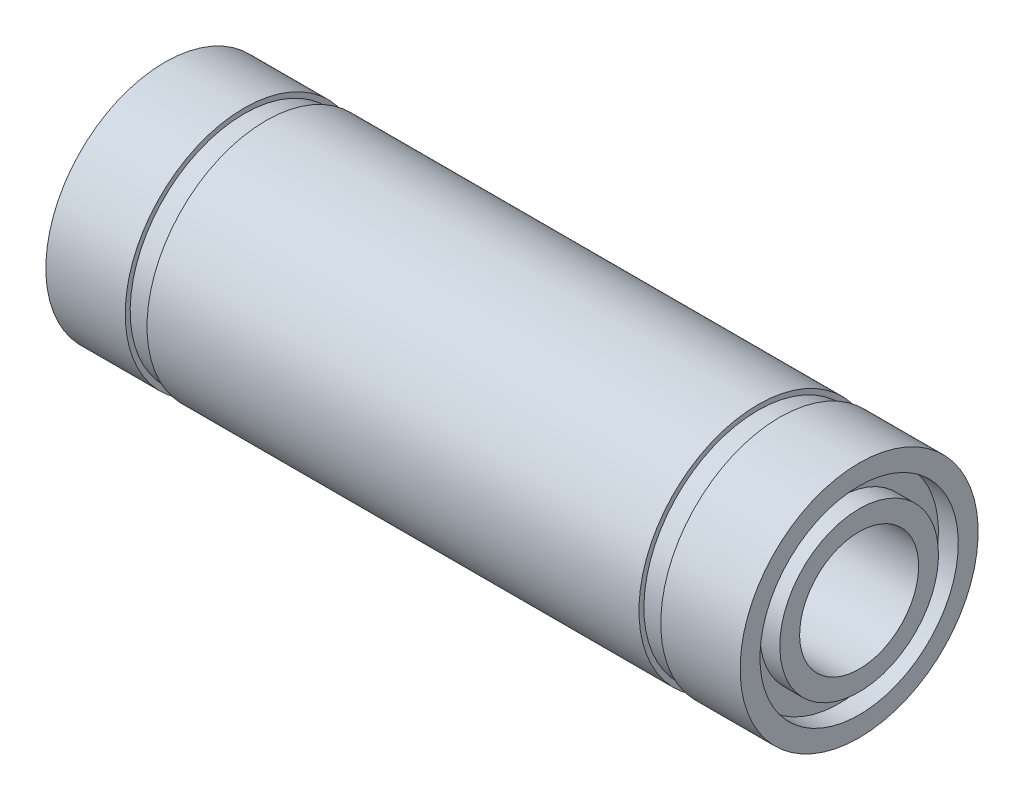
ISO-10303-21;
HEADER;
FILE_DESCRIPTION(('STEP AP214'),'2;1');
FILE_NAME('part.step','',(''),(''),'','','');
FILE_SCHEMA(('AUTOMOTIVE_DESIGN { 1 0 10303 214 1 1 1 1 }'));
ENDSEC;
DATA;
#1=APPLICATION_CONTEXT('core data for automotive mechanical design processes');
#2=APPLICATION_PROTOCOL_DEFINITION('international standard','automotive_design',2000,#1);
#3=PRODUCT_CONTEXT('',#1,'mechanical');
#4=PRODUCT('Part','Part','',(#3));
#5=PRODUCT_RELATED_PRODUCT_CATEGORY('part','',(#4));
#6=PRODUCT_DEFINITION_FORMATION('','',#4);
#7=PRODUCT_DEFINITION_CONTEXT('part definition',#1,'design');
#8=PRODUCT_DEFINITION('design','',#6,#7);
#9=PRODUCT_DEFINITION_SHAPE('','',#8);
#10=(LENGTH_UNIT() NAMED_UNIT(*) SI_UNIT(.MILLI.,.METRE.));
#11=(NAMED_UNIT(*) PLANE_ANGLE_UNIT() SI_UNIT($,.RADIAN.));
#12=(NAMED_UNIT(*) SI_UNIT($,.STERADIAN.) SOLID_ANGLE_UNIT());
#13=UNCERTAINTY_MEASURE_WITH_UNIT(LENGTH_MEASURE(1.E-05),#10,'distance_accuracy_value','');
#14=(GEOMETRIC_REPRESENTATION_CONTEXT(3) GLOBAL_UNCERTAINTY_ASSIGNED_CONTEXT((#13)) GLOBAL_UNIT_ASSIGNED_CONTEXT((#10,
#11,#12)) REPRESENTATION_CONTEXT('',''));
#15=CARTESIAN_POINT('',(0.,0.,0.));
#16=DIRECTION('',(0.,0.,1.));
#17=DIRECTION('',(1.,0.,0.));
#18=AXIS2_PLACEMENT_3D('',#15,#16,#17);
#19=CARTESIAN_POINT('',(-17.5,5.,0.));
#20=DIRECTION('',(-1.,0.,0.));
#21=DIRECTION('',(0.,-1.,0.));
#22=AXIS2_PLACEMENT_3D('',#19,#20,#21);
#23=PLANE('',#22);
#24=CARTESIAN_POINT('',(-17.5,0.,0.));
#25=DIRECTION('',(1.,0.,0.));
#26=DIRECTION('',(0.,1.,0.));
#27=AXIS2_PLACEMENT_3D('',#24,#25,#26);
#28=CIRCLE('',#27,5.);
#29=CARTESIAN_POINT('',(-17.5,5.,0.));
#30=VERTEX_POINT('',#29);
#31=EDGE_CURVE('E124',#30,#30,#28,.T.);
#32=ORIENTED_EDGE('',*,*,#31,.T.);
#33=EDGE_LOOP('',(#32));
#34=FACE_BOUND('',#33,.T.);
#35=CARTESIAN_POINT('',(-17.5,0.,0.));
#36=DIRECTION('',(1.,0.,0.));
#37=DIRECTION('',(0.,1.,0.));
#38=AXIS2_PLACEMENT_3D('',#35,#36,#37);
#39=CIRCLE('',#38,6.);
#40=CARTESIAN_POINT('',(-17.5,6.,0.));
#41=VERTEX_POINT('',#40);
#42=EDGE_CURVE('E10',#41,#41,#39,.T.);
#43=ORIENTED_EDGE('',*,*,#42,.F.);
#44=EDGE_LOOP('',(#43));
#45=FACE_BOUND('',#44,.T.);
#46=ADVANCED_FACE('F40',(#34,#45),#23,.T.);
#47=CARTESIAN_POINT('',(0.,0.,0.));
#48=DIRECTION('',(1.,0.,0.));
#49=DIRECTION('',(0.,1.,0.));
#50=AXIS2_PLACEMENT_3D('',#47,#48,#49);
#51=CYLINDRICAL_SURFACE('',#50,6.);
#52=ORIENTED_EDGE('',*,*,#42,.T.);
#53=EDGE_LOOP('',(#52));
#54=FACE_BOUND('',#53,.T.);
#55=CARTESIAN_POINT('',(-13.5,0.,0.));
#56=DIRECTION('',(1.,0.,0.));
#57=DIRECTION('',(0.,1.,0.));
#58=AXIS2_PLACEMENT_3D('',#55,#56,#57);
#59=CIRCLE('',#58,6.);
#60=CARTESIAN_POINT('',(-13.5,6.,0.));
#61=VERTEX_POINT('',#60);
#62=EDGE_CURVE('E47',#61,#61,#59,.T.);
#63=ORIENTED_EDGE('',*,*,#62,.F.);
#64=EDGE_LOOP('',(#63));
#65=FACE_BOUND('',#64,.T.);
#66=ADVANCED_FACE('F142',(#54,#65),#51,.T.);
#67=CARTESIAN_POINT('',(-13.5,6.,0.));
#68=DIRECTION('',(1.,0.,0.));
#69=DIRECTION('',(0.,1.,0.));
#70=AXIS2_PLACEMENT_3D('',#67,#68,#69);
#71=PLANE('',#70);
#72=ORIENTED_EDGE('',*,*,#62,.T.);
#73=EDGE_LOOP('',(#72));
#74=FACE_BOUND('',#73,.T.);
#75=CARTESIAN_POINT('',(-13.5,0.,0.));
#76=DIRECTION('',(1.,0.,0.));
#77=DIRECTION('',(0.,1.,0.));
#78=AXIS2_PLACEMENT_3D('',#75,#76,#77);
#79=CIRCLE('',#78,5.75);
#80=CARTESIAN_POINT('',(-13.5,5.75,0.));
#81=VERTEX_POINT('',#80);
#82=EDGE_CURVE('E54',#81,#81,#79,.T.);
#83=ORIENTED_EDGE('',*,*,#82,.F.);
#84=EDGE_LOOP('',(#83));
#85=FACE_BOUND('',#84,.T.);
#86=ADVANCED_FACE('F146',(#74,#85),#71,.T.);
#87=CARTESIAN_POINT('',(0.,0.,0.));
#88=DIRECTION('',(1.,0.,0.));
#89=DIRECTION('',(0.,1.,0.));
#90=AXIS2_PLACEMENT_3D('',#87,#88,#89);
#91=CYLINDRICAL_SURFACE('',#90,5.75);
#92=ORIENTED_EDGE('',*,*,#82,.T.);
#93=EDGE_LOOP('',(#92));
#94=FACE_BOUND('',#93,.T.);
#95=CARTESIAN_POINT('',(-12.4,0.,0.));
#96=DIRECTION('',(1.,0.,0.));
#97=DIRECTION('',(0.,1.,0.));
#98=AXIS2_PLACEMENT_3D('',#95,#96,#97);
#99=CIRCLE('',#98,5.75);
#100=CARTESIAN_POINT('',(-12.4,5.75,0.));
#101=VERTEX_POINT('',#100);
#102=EDGE_CURVE('E60',#101,#101,#99,.T.);
#103=ORIENTED_EDGE('',*,*,#102,.F.);
#104=EDGE_LOOP('',(#103));
#105=FACE_BOUND('',#104,.T.);
#106=ADVANCED_FACE('F150',(#94,#105),#91,.T.);
#107=CARTESIAN_POINT('',(-12.4,5.75,0.));
#108=DIRECTION('',(-1.,0.,0.));
#109=DIRECTION('',(0.,-1.,0.));
#110=AXIS2_PLACEMENT_3D('',#107,#108,#109);
#111=PLANE('',#110);
#112=ORIENTED_EDGE('',*,*,#102,.T.);
#113=EDGE_LOOP('',(#112));
#114=FACE_BOUND('',#113,.T.);
#115=CARTESIAN_POINT('',(-12.4,0.,0.));
#116=DIRECTION('',(1.,0.,0.));
#117=DIRECTION('',(0.,1.,0.));
#118=AXIS2_PLACEMENT_3D('',#115,#116,#117);
#119=CIRCLE('',#118,6.);
#120=CARTESIAN_POINT('',(-12.4,6.,0.));
#121=VERTEX_POINT('',#120);
#122=EDGE_CURVE('E66',#121,#121,#119,.T.);
#123=ORIENTED_EDGE('',*,*,#122,.F.);
#124=EDGE_LOOP('',(#123));
#125=FACE_BOUND('',#124,.T.);
#126=ADVANCED_FACE('F156',(#114,#125),#111,.T.);
#127=CARTESIAN_POINT('',(0.,0.,0.));
#128=DIRECTION('',(1.,0.,0.));
#129=DIRECTION('',(0.,1.,0.));
#130=AXIS2_PLACEMENT_3D('',#127,#128,#129);
#131=CYLINDRICAL_SURFACE('',#130,6.);
#132=ORIENTED_EDGE('',*,*,#122,.T.);
#133=EDGE_LOOP('',(#132));
#134=FACE_BOUND('',#133,.T.);
#135=CARTESIAN_POINT('',(12.4,0.,0.));
#136=DIRECTION('',(1.,0.,0.));
#137=DIRECTION('',(0.,1.,0.));
#138=AXIS2_PLACEMENT_3D('',#135,#136,#137);
#139=CIRCLE('',#138,6.);
#140=CARTESIAN_POINT('',(12.4,6.,0.));
#141=VERTEX_POINT('',#140);
#142=EDGE_CURVE('E70',#141,#141,#139,.T.);
#143=ORIENTED_EDGE('',*,*,#142,.F.);
#144=EDGE_LOOP('',(#143));
#145=FACE_BOUND('',#144,.T.);
#146=ADVANCED_FACE('F160',(#134,#145),#131,.T.);
#147=CARTESIAN_POINT('',(12.4,6.,0.));
#148=DIRECTION('',(1.,0.,0.));
#149=DIRECTION('',(0.,1.,0.));
#150=AXIS2_PLACEMENT_3D('',#147,#148,#149);
#151=PLANE('',#150);
#152=ORIENTED_EDGE('',*,*,#142,.T.);
#153=EDGE_LOOP('',(#152));
#154=FACE_BOUND('',#153,.T.);
#155=CARTESIAN_POINT('',(12.4,0.,0.));
#156=DIRECTION('',(1.,0.,0.));
#157=DIRECTION('',(0.,1.,0.));
#158=AXIS2_PLACEMENT_3D('',#155,#156,#157);
#159=CIRCLE('',#158,5.75);
#160=CARTESIAN_POINT('',(12.4,5.75,0.));
#161=VERTEX_POINT('',#160);
#162=EDGE_CURVE('E74',#161,#161,#159,.T.);
#163=ORIENTED_EDGE('',*,*,#162,.F.);
#164=EDGE_LOOP('',(#163));
#165=FACE_BOUND('',#164,.T.);
#166=ADVANCED_FACE('F164',(#154,#165),#151,.T.);
#167=CARTESIAN_POINT('',(0.,0.,0.));
#168=DIRECTION('',(1.,0.,0.));
#169=DIRECTION('',(0.,1.,0.));
#170=AXIS2_PLACEMENT_3D('',#167,#168,#169);
#171=CYLINDRICAL_SURFACE('',#170,5.75);
#172=ORIENTED_EDGE('',*,*,#162,.T.);
#173=EDGE_LOOP('',(#172));
#174=FACE_BOUND('',#173,.T.);
#175=CARTESIAN_POINT('',(13.5,0.,0.));
#176=DIRECTION('',(1.,0.,0.));
#177=DIRECTION('',(0.,1.,0.));
#178=AXIS2_PLACEMENT_3D('',#175,#176,#177);
#179=CIRCLE('',#178,5.75);
#180=CARTESIAN_POINT('',(13.5,5.75,0.));
#181=VERTEX_POINT('',#180);
#182=EDGE_CURVE('E78',#181,#181,#179,.T.);
#183=ORIENTED_EDGE('',*,*,#182,.F.);
#184=EDGE_LOOP('',(#183));
#185=FACE_BOUND('',#184,.T.);
#186=ADVANCED_FACE('F168',(#174,#185),#171,.T.);
#187=CARTESIAN_POINT('',(13.5,5.75,0.));
#188=DIRECTION('',(-1.,0.,0.));
#189=DIRECTION('',(0.,-1.,0.));
#190=AXIS2_PLACEMENT_3D('',#187,#188,#189);
#191=PLANE('',#190);
#192=ORIENTED_EDGE('',*,*,#182,.T.);
#193=EDGE_LOOP('',(#192));
#194=FACE_BOUND('',#193,.T.);
#195=CARTESIAN_POINT('',(13.5,0.,0.));
#196=DIRECTION('',(1.,0.,0.));
#197=DIRECTION('',(0.,1.,0.));
#198=AXIS2_PLACEMENT_3D('',#195,#196,#197);
#199=CIRCLE('',#198,6.);
#200=CARTESIAN_POINT('',(13.5,6.,0.));
#201=VERTEX_POINT('',#200);
#202=EDGE_CURVE('E82',#201,#201,#199,.T.);
#203=ORIENTED_EDGE('',*,*,#202,.F.);
#204=EDGE_LOOP('',(#203));
#205=FACE_BOUND('',#204,.T.);
#206=ADVANCED_FACE('F172',(#194,#205),#191,.T.);
#207=CARTESIAN_POINT('',(0.,0.,0.));
#208=DIRECTION('',(1.,0.,0.));
#209=DIRECTION('',(0.,1.,0.));
#210=AXIS2_PLACEMENT_3D('',#207,#208,#209);
#211=CYLINDRICAL_SURFACE('',#210,6.00000000000001);
#212=ORIENTED_EDGE('',*,*,#202,.T.);
#213=EDGE_LOOP('',(#212));
#214=FACE_BOUND('',#213,.T.);
#215=CARTESIAN_POINT('',(17.5,0.,0.));
#216=DIRECTION('',(1.,0.,0.));
#217=DIRECTION('',(0.,1.,0.));
#218=AXIS2_PLACEMENT_3D('',#215,#216,#217);
#219=CIRCLE('',#218,6.00000000000001);
#220=CARTESIAN_POINT('',(17.5,6.00000000000001,0.));
#221=VERTEX_POINT('',#220);
#222=EDGE_CURVE('E86',#221,#221,#219,.T.);
#223=ORIENTED_EDGE('',*,*,#222,.F.);
#224=EDGE_LOOP('',(#223));
#225=FACE_BOUND('',#224,.T.);
#226=ADVANCED_FACE('F176',(#214,#225),#211,.T.);
#227=CARTESIAN_POINT('',(17.5,6.00000000000001,0.));
#228=DIRECTION('',(1.,0.,0.));
#229=DIRECTION('',(0.,1.,0.));
#230=AXIS2_PLACEMENT_3D('',#227,#228,#229);
#231=PLANE('',#230);
#232=ORIENTED_EDGE('',*,*,#222,.T.);
#233=EDGE_LOOP('',(#232));
#234=FACE_BOUND('',#233,.T.);
#235=CARTESIAN_POINT('',(17.5,0.,0.));
#236=DIRECTION('',(1.,0.,0.));
#237=DIRECTION('',(0.,1.,0.));
#238=AXIS2_PLACEMENT_3D('',#235,#236,#237);
#239=CIRCLE('',#238,5.);
#240=CARTESIAN_POINT('',(17.5,5.00000000000001,0.));
#241=VERTEX_POINT('',#240);
#242=EDGE_CURVE('E89',#241,#241,#239,.T.);
#243=ORIENTED_EDGE('',*,*,#242,.F.);
#244=EDGE_LOOP('',(#243));
#245=FACE_BOUND('',#244,.T.);
#246=ADVANCED_FACE('F180',(#234,#245),#231,.T.);
#247=CARTESIAN_POINT('',(0.,0.,0.));
#248=DIRECTION('',(1.,0.,0.));
#249=DIRECTION('',(0.,1.,0.));
#250=AXIS2_PLACEMENT_3D('',#247,#248,#249);
#251=CYLINDRICAL_SURFACE('',#250,5.);
#252=ORIENTED_EDGE('',*,*,#242,.T.);
#253=EDGE_LOOP('',(#252));
#254=FACE_BOUND('',#253,.T.);
#255=CARTESIAN_POINT('',(16.5,0.,0.));
#256=DIRECTION('',(1.,0.,0.));
#257=DIRECTION('',(0.,1.,0.));
#258=AXIS2_PLACEMENT_3D('',#255,#256,#257);
#259=CIRCLE('',#258,5.);
#260=CARTESIAN_POINT('',(16.5,5.00000000000001,0.));
#261=VERTEX_POINT('',#260);
#262=EDGE_CURVE('E93',#261,#261,#259,.T.);
#263=ORIENTED_EDGE('',*,*,#262,.F.);
#264=EDGE_LOOP('',(#263));
#265=FACE_BOUND('',#264,.T.);
#266=ADVANCED_FACE('F184',(#254,#265),#251,.F.);
#267=CARTESIAN_POINT('',(16.5,5.00000000000001,0.));
#268=DIRECTION('',(1.,0.,0.));
#269=DIRECTION('',(0.,1.,0.));
#270=AXIS2_PLACEMENT_3D('',#267,#268,#269);
#271=PLANE('',#270);
#272=ORIENTED_EDGE('',*,*,#262,.T.);
#273=EDGE_LOOP('',(#272));
#274=FACE_BOUND('',#273,.T.);
#275=CARTESIAN_POINT('',(16.5,0.,0.));
#276=DIRECTION('',(1.,0.,0.));
#277=DIRECTION('',(0.,1.,0.));
#278=AXIS2_PLACEMENT_3D('',#275,#276,#277);
#279=CIRCLE('',#278,4.);
#280=CARTESIAN_POINT('',(16.5,4.00000000000001,0.));
#281=VERTEX_POINT('',#280);
#282=EDGE_CURVE('E97',#281,#281,#279,.T.);
#283=ORIENTED_EDGE('',*,*,#282,.F.);
#284=EDGE_LOOP('',(#283));
#285=FACE_BOUND('',#284,.T.);
#286=ADVANCED_FACE('F188',(#274,#285),#271,.T.);
#287=CARTESIAN_POINT('',(0.,0.,0.));
#288=DIRECTION('',(1.,0.,0.));
#289=DIRECTION('',(0.,1.,0.));
#290=AXIS2_PLACEMENT_3D('',#287,#288,#289);
#291=CYLINDRICAL_SURFACE('',#290,4.);
#292=ORIENTED_EDGE('',*,*,#282,.T.);
#293=EDGE_LOOP('',(#292));
#294=FACE_BOUND('',#293,.T.);
#295=CARTESIAN_POINT('',(17.5,0.,0.));
#296=DIRECTION('',(1.,0.,0.));
#297=DIRECTION('',(0.,1.,0.));
#298=AXIS2_PLACEMENT_3D('',#295,#296,#297);
#299=CIRCLE('',#298,4.);
#300=CARTESIAN_POINT('',(17.5,4.00000000000001,0.));
#301=VERTEX_POINT('',#300);
#302=EDGE_CURVE('E101',#301,#301,#299,.T.);
#303=ORIENTED_EDGE('',*,*,#302,.F.);
#304=EDGE_LOOP('',(#303));
#305=FACE_BOUND('',#304,.T.);
#306=ADVANCED_FACE('F192',(#294,#305),#291,.T.);
#307=CARTESIAN_POINT('',(17.5,4.00000000000001,0.));
#308=DIRECTION('',(1.,0.,0.));
#309=DIRECTION('',(0.,1.,0.));
#310=AXIS2_PLACEMENT_3D('',#307,#308,#309);
#311=PLANE('',#310);
#312=ORIENTED_EDGE('',*,*,#302,.T.);
#313=EDGE_LOOP('',(#312));
#314=FACE_BOUND('',#313,.T.);
#315=CARTESIAN_POINT('',(17.5,0.,0.));
#316=DIRECTION('',(1.,0.,0.));
#317=DIRECTION('',(0.,1.,0.));
#318=AXIS2_PLACEMENT_3D('',#315,#316,#317);
#319=CIRCLE('',#318,3.);
#320=CARTESIAN_POINT('',(17.5,3.,0.));
#321=VERTEX_POINT('',#320);
#322=EDGE_CURVE('E105',#321,#321,#319,.T.);
#323=ORIENTED_EDGE('',*,*,#322,.F.);
#324=EDGE_LOOP('',(#323));
#325=FACE_BOUND('',#324,.T.);
#326=ADVANCED_FACE('F196',(#314,#325),#311,.T.);
#327=CARTESIAN_POINT('',(0.,0.,0.));
#328=DIRECTION('',(1.,0.,0.));
#329=DIRECTION('',(0.,1.,0.));
#330=AXIS2_PLACEMENT_3D('',#327,#328,#329);
#331=CYLINDRICAL_SURFACE('',#330,3.);
#332=ORIENTED_EDGE('',*,*,#322,.T.);
#333=EDGE_LOOP('',(#332));
#334=FACE_BOUND('',#333,.T.);
#335=CARTESIAN_POINT('',(-17.5,0.,0.));
#336=DIRECTION('',(1.,0.,0.));
#337=DIRECTION('',(0.,1.,0.));
#338=AXIS2_PLACEMENT_3D('',#335,#336,#337);
#339=CIRCLE('',#338,3.);
#340=CARTESIAN_POINT('',(-17.5,3.,0.));
#341=VERTEX_POINT('',#340);
#342=EDGE_CURVE('E109',#341,#341,#339,.T.);
#343=ORIENTED_EDGE('',*,*,#342,.F.);
#344=EDGE_LOOP('',(#343));
#345=FACE_BOUND('',#344,.T.);
#346=ADVANCED_FACE('F200',(#334,#345),#331,.F.);
#347=CARTESIAN_POINT('',(-17.5,3.,0.));
#348=DIRECTION('',(-1.,0.,0.));
#349=DIRECTION('',(0.,-1.,0.));
#350=AXIS2_PLACEMENT_3D('',#347,#348,#349);
#351=PLANE('',#350);
#352=ORIENTED_EDGE('',*,*,#342,.T.);
#353=EDGE_LOOP('',(#352));
#354=FACE_BOUND('',#353,.T.);
#355=CARTESIAN_POINT('',(-17.5,0.,0.));
#356=DIRECTION('',(1.,0.,0.));
#357=DIRECTION('',(0.,1.,0.));
#358=AXIS2_PLACEMENT_3D('',#355,#356,#357);
#359=CIRCLE('',#358,4.);
#360=CARTESIAN_POINT('',(-17.5,4.,0.));
#361=VERTEX_POINT('',#360);
#362=EDGE_CURVE('E112',#361,#361,#359,.T.);
#363=ORIENTED_EDGE('',*,*,#362,.F.);
#364=EDGE_LOOP('',(#363));
#365=FACE_BOUND('',#364,.T.);
#366=ADVANCED_FACE('F204',(#354,#365),#351,.T.);
#367=CARTESIAN_POINT('',(0.,0.,0.));
#368=DIRECTION('',(1.,0.,0.));
#369=DIRECTION('',(0.,1.,0.));
#370=AXIS2_PLACEMENT_3D('',#367,#368,#369);
#371=CYLINDRICAL_SURFACE('',#370,4.);
#372=ORIENTED_EDGE('',*,*,#362,.T.);
#373=EDGE_LOOP('',(#372));
#374=FACE_BOUND('',#373,.T.);
#375=CARTESIAN_POINT('',(-16.5,0.,0.));
#376=DIRECTION('',(1.,0.,0.));
#377=DIRECTION('',(0.,1.,0.));
#378=AXIS2_PLACEMENT_3D('',#375,#376,#377);
#379=CIRCLE('',#378,4.);
#380=CARTESIAN_POINT('',(-16.5,4.,0.));
#381=VERTEX_POINT('',#380);
#382=EDGE_CURVE('E116',#381,#381,#379,.T.);
#383=ORIENTED_EDGE('',*,*,#382,.F.);
#384=EDGE_LOOP('',(#383));
#385=FACE_BOUND('',#384,.T.);
#386=ADVANCED_FACE('F138',(#374,#385),#371,.T.);
#387=CARTESIAN_POINT('',(-16.5,5.,0.));
#388=DIRECTION('',(-1.,0.,0.));
#389=DIRECTION('',(0.,-1.,0.));
#390=AXIS2_PLACEMENT_3D('',#387,#388,#389);
#391=PLANE('',#390);
#392=ORIENTED_EDGE('',*,*,#382,.T.);
#393=EDGE_LOOP('',(#392));
#394=FACE_BOUND('',#393,.T.);
#395=CARTESIAN_POINT('',(-16.5,0.,0.));
#396=DIRECTION('',(1.,0.,0.));
#397=DIRECTION('',(0.,1.,0.));
#398=AXIS2_PLACEMENT_3D('',#395,#396,#397);
#399=CIRCLE('',#398,5.);
#400=CARTESIAN_POINT('',(-16.5,5.,0.));
#401=VERTEX_POINT('',#400);
#402=EDGE_CURVE('E120',#401,#401,#399,.T.);
#403=ORIENTED_EDGE('',*,*,#402,.F.);
#404=EDGE_LOOP('',(#403));
#405=FACE_BOUND('',#404,.T.);
#406=ADVANCED_FACE('F132',(#394,#405),#391,.T.);
#407=CARTESIAN_POINT('',(0.,0.,0.));
#408=DIRECTION('',(1.,0.,0.));
#409=DIRECTION('',(0.,1.,0.));
#410=AXIS2_PLACEMENT_3D('',#407,#408,#409);
#411=CYLINDRICAL_SURFACE('',#410,5.);
#412=ORIENTED_EDGE('',*,*,#402,.T.);
#413=EDGE_LOOP('',(#412));
#414=FACE_BOUND('',#413,.T.);
#415=ORIENTED_EDGE('',*,*,#31,.F.);
#416=EDGE_LOOP('',(#415));
#417=FACE_BOUND('',#416,.T.);
#418=ADVANCED_FACE('F130',(#414,#417),#411,.F.);
#419=CLOSED_SHELL('',(#46,#66,#86,#106,#126,#146,#166,#186,#206,#226,#246,#266,#286,#306,#326,
#346,#366,#386,#406,#418));
#420=MANIFOLD_SOLID_BREP('B2',#419);
#421=ADVANCED_BREP_SHAPE_REPRESENTATION('',(#18,#420),#14);
#422=SHAPE_DEFINITION_REPRESENTATION(#9,#421);
ENDSEC;
END-ISO-10303-21;
